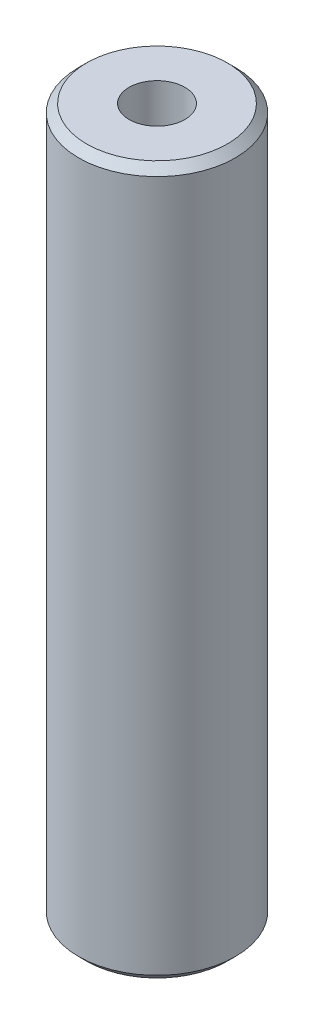
ISO-10303-21;
HEADER;
FILE_DESCRIPTION(('STEP AP214'),'2;1');
FILE_NAME('part.step','',(''),(''),'','','');
FILE_SCHEMA(('AUTOMOTIVE_DESIGN { 1 0 10303 214 1 1 1 1 }'));
ENDSEC;
DATA;
#1=APPLICATION_CONTEXT('core data for automotive mechanical design processes');
#2=APPLICATION_PROTOCOL_DEFINITION('international standard','automotive_design',2000,#1);
#3=PRODUCT_CONTEXT('',#1,'mechanical');
#4=PRODUCT('Part','Part','',(#3));
#5=PRODUCT_RELATED_PRODUCT_CATEGORY('part','',(#4));
#6=PRODUCT_DEFINITION_FORMATION('','',#4);
#7=PRODUCT_DEFINITION_CONTEXT('part definition',#1,'design');
#8=PRODUCT_DEFINITION('design','',#6,#7);
#9=PRODUCT_DEFINITION_SHAPE('','',#8);
#10=(LENGTH_UNIT() NAMED_UNIT(*) SI_UNIT(.MILLI.,.METRE.));
#11=(NAMED_UNIT(*) PLANE_ANGLE_UNIT() SI_UNIT($,.RADIAN.));
#12=(NAMED_UNIT(*) SI_UNIT($,.STERADIAN.) SOLID_ANGLE_UNIT());
#13=UNCERTAINTY_MEASURE_WITH_UNIT(LENGTH_MEASURE(1.E-05),#10,'distance_accuracy_value','');
#14=(GEOMETRIC_REPRESENTATION_CONTEXT(3) GLOBAL_UNCERTAINTY_ASSIGNED_CONTEXT((#13)) GLOBAL_UNIT_ASSIGNED_CONTEXT((#10,
#11,#12)) REPRESENTATION_CONTEXT('',''));
#15=CARTESIAN_POINT('',(0.,0.,0.));
#16=DIRECTION('',(0.,0.,1.));
#17=DIRECTION('',(1.,0.,0.));
#18=AXIS2_PLACEMENT_3D('',#15,#16,#17);
#19=CARTESIAN_POINT('',(0.,248.415206450771,0.));
#20=DIRECTION('',(0.,-1.,0.));
#21=DIRECTION('',(0.,0.,-1.));
#22=AXIS2_PLACEMENT_3D('',#19,#20,#21);
#23=CYLINDRICAL_SURFACE('',#22,27.5);
#24=CARTESIAN_POINT('',(0.,245.599400820441,0.));
#25=DIRECTION('',(0.,1.,0.));
#26=DIRECTION('',(0.,0.,1.));
#27=AXIS2_PLACEMENT_3D('',#24,#25,#26);
#28=CIRCLE('',#27,27.5);
#29=CARTESIAN_POINT('',(0.,245.599400820441,27.5));
#30=VERTEX_POINT('',#29);
#31=EDGE_CURVE('E50',#30,#30,#28,.F.);
#32=ORIENTED_EDGE('',*,*,#31,.T.);
#33=EDGE_LOOP('',(#32));
#34=FACE_BOUND('',#33,.T.);
#35=CARTESIAN_POINT('',(0.,2.81580563033057,0.));
#36=DIRECTION('',(0.,1.,0.));
#37=DIRECTION('',(0.,0.,1.));
#38=AXIS2_PLACEMENT_3D('',#35,#36,#37);
#39=CIRCLE('',#38,27.5);
#40=CARTESIAN_POINT('',(0.,2.81580563033057,27.5));
#41=VERTEX_POINT('',#40);
#42=EDGE_CURVE('E51',#41,#41,#39,.T.);
#43=ORIENTED_EDGE('',*,*,#42,.T.);
#44=EDGE_LOOP('',(#43));
#45=FACE_BOUND('',#44,.T.);
#46=ADVANCED_FACE('F39',(#34,#45),#23,.T.);
#47=CARTESIAN_POINT('',(0.,248.415206450771,0.));
#48=DIRECTION('',(0.,1.,0.));
#49=DIRECTION('',(0.,0.,1.));
#50=AXIS2_PLACEMENT_3D('',#47,#48,#49);
#51=PLANE('',#50);
#52=CARTESIAN_POINT('',(0.,248.415206450771,0.));
#53=DIRECTION('',(0.,1.,0.));
#54=DIRECTION('',(0.,0.,1.));
#55=AXIS2_PLACEMENT_3D('',#52,#53,#54);
#56=CIRCLE('',#55,24.6841943696695);
#57=CARTESIAN_POINT('',(0.,248.415206450771,24.6841943696695));
#58=VERTEX_POINT('',#57);
#59=EDGE_CURVE('E54',#58,#58,#56,.T.);
#60=ORIENTED_EDGE('',*,*,#59,.T.);
#61=EDGE_LOOP('',(#60));
#62=FACE_BOUND('',#61,.T.);
#63=CARTESIAN_POINT('',(0.,248.415206450771,0.));
#64=DIRECTION('',(0.,1.,0.));
#65=DIRECTION('',(0.,0.,1.));
#66=AXIS2_PLACEMENT_3D('',#63,#64,#65);
#67=CIRCLE('',#66,9.79653698699629);
#68=CARTESIAN_POINT('',(0.,248.415206450771,9.79653698699629));
#69=VERTEX_POINT('',#68);
#70=EDGE_CURVE('E58',#69,#69,#67,.T.);
#71=ORIENTED_EDGE('',*,*,#70,.F.);
#72=EDGE_LOOP('',(#71));
#73=FACE_BOUND('',#72,.T.);
#74=ADVANCED_FACE('F69',(#62,#73),#51,.T.);
#75=CARTESIAN_POINT('',(0.,0.,0.));
#76=DIRECTION('',(0.,1.,0.));
#77=DIRECTION('',(0.,0.,1.));
#78=AXIS2_PLACEMENT_3D('',#75,#76,#77);
#79=PLANE('',#78);
#80=CARTESIAN_POINT('',(0.,0.,0.));
#81=DIRECTION('',(0.,1.,0.));
#82=DIRECTION('',(0.,0.,1.));
#83=AXIS2_PLACEMENT_3D('',#80,#81,#82);
#84=CIRCLE('',#83,24.6841943696694);
#85=CARTESIAN_POINT('',(0.,0.,24.6841943696694));
#86=VERTEX_POINT('',#85);
#87=EDGE_CURVE('E10',#86,#86,#84,.F.);
#88=ORIENTED_EDGE('',*,*,#87,.T.);
#89=EDGE_LOOP('',(#88));
#90=FACE_BOUND('',#89,.T.);
#91=CARTESIAN_POINT('',(0.,0.,0.));
#92=DIRECTION('',(0.,1.,0.));
#93=DIRECTION('',(0.,0.,1.));
#94=AXIS2_PLACEMENT_3D('',#91,#92,#93);
#95=CIRCLE('',#94,9.79653698699629);
#96=CARTESIAN_POINT('',(0.,0.,9.79653698699629));
#97=VERTEX_POINT('',#96);
#98=EDGE_CURVE('E63',#97,#97,#95,.T.);
#99=ORIENTED_EDGE('',*,*,#98,.T.);
#100=EDGE_LOOP('',(#99));
#101=FACE_BOUND('',#100,.T.);
#102=ADVANCED_FACE('F75',(#90,#101),#79,.F.);
#103=CARTESIAN_POINT('',(0.,248.415206450771,0.));
#104=DIRECTION('',(0.,-1.,0.));
#105=DIRECTION('',(0.,0.,-1.));
#106=AXIS2_PLACEMENT_3D('',#103,#104,#105);
#107=CYLINDRICAL_SURFACE('',#106,9.79653698699629);
#108=ORIENTED_EDGE('',*,*,#70,.T.);
#109=EDGE_LOOP('',(#108));
#110=FACE_BOUND('',#109,.T.);
#111=ORIENTED_EDGE('',*,*,#98,.F.);
#112=EDGE_LOOP('',(#111));
#113=FACE_BOUND('',#112,.T.);
#114=ADVANCED_FACE('F70',(#110,#113),#107,.F.);
#115=CARTESIAN_POINT('',(0.,248.415206450771,0.));
#116=DIRECTION('',(0.,-1.,0.));
#117=DIRECTION('',(0.,0.,-1.));
#118=AXIS2_PLACEMENT_3D('',#115,#116,#117);
#119=CONICAL_SURFACE('',#118,24.6841943696695,0.785398163397445);
#120=ORIENTED_EDGE('',*,*,#31,.F.);
#121=EDGE_LOOP('',(#120));
#122=FACE_BOUND('',#121,.T.);
#123=ORIENTED_EDGE('',*,*,#59,.F.);
#124=EDGE_LOOP('',(#123));
#125=FACE_BOUND('',#124,.T.);
#126=ADVANCED_FACE('F81',(#122,#125),#119,.T.);
#127=CARTESIAN_POINT('',(0.,2.81580563033057,0.));
#128=DIRECTION('',(0.,1.,0.));
#129=DIRECTION('',(0.,0.,1.));
#130=AXIS2_PLACEMENT_3D('',#127,#128,#129);
#131=CONICAL_SURFACE('',#130,27.5,0.78539816339745);
#132=ORIENTED_EDGE('',*,*,#87,.F.);
#133=EDGE_LOOP('',(#132));
#134=FACE_BOUND('',#133,.T.);
#135=ORIENTED_EDGE('',*,*,#42,.F.);
#136=EDGE_LOOP('',(#135));
#137=FACE_BOUND('',#136,.T.);
#138=ADVANCED_FACE('F45',(#134,#137),#131,.T.);
#139=CLOSED_SHELL('',(#46,#74,#102,#114,#126,#138));
#140=MANIFOLD_SOLID_BREP('B2',#139);
#141=ADVANCED_BREP_SHAPE_REPRESENTATION('',(#18,#140),#14);
#142=SHAPE_DEFINITION_REPRESENTATION(#9,#141);
ENDSEC;
END-ISO-10303-21;
